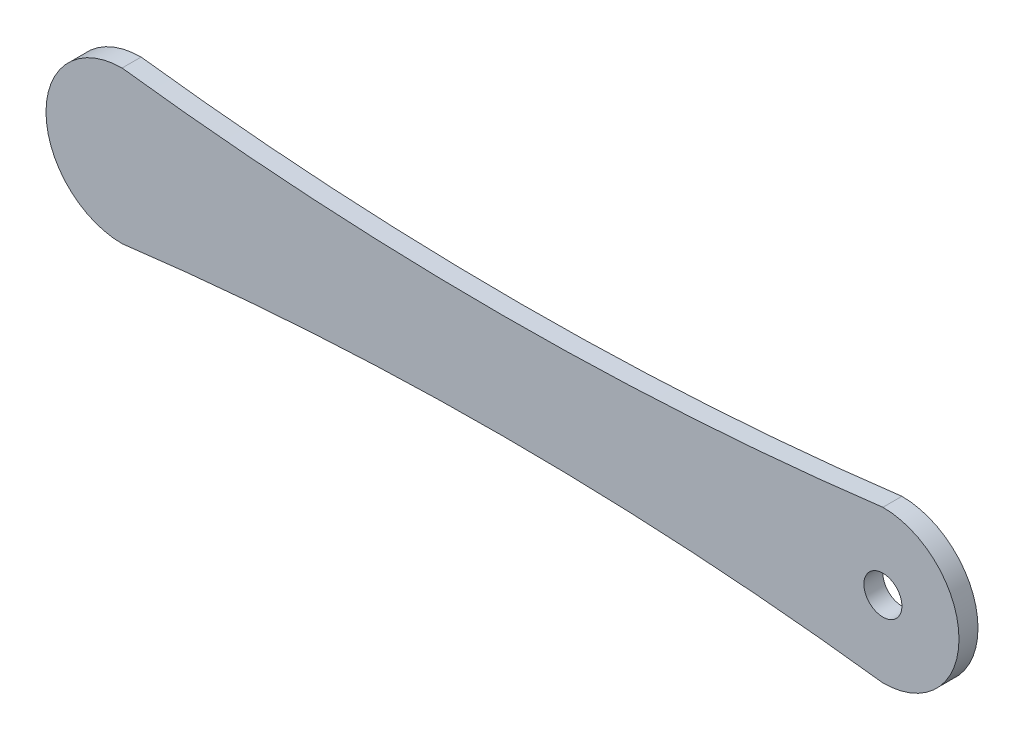
ISO-10303-21;
HEADER;
FILE_DESCRIPTION(('STEP AP214'),'2;1');
FILE_NAME('part.step','',(''),(''),'','','');
FILE_SCHEMA(('AUTOMOTIVE_DESIGN { 1 0 10303 214 1 1 1 1 }'));
ENDSEC;
DATA;
#1=APPLICATION_CONTEXT('core data for automotive mechanical design processes');
#2=APPLICATION_PROTOCOL_DEFINITION('international standard','automotive_design',2000,#1);
#3=PRODUCT_CONTEXT('',#1,'mechanical');
#4=PRODUCT('Part','Part','',(#3));
#5=PRODUCT_RELATED_PRODUCT_CATEGORY('part','',(#4));
#6=PRODUCT_DEFINITION_FORMATION('','',#4);
#7=PRODUCT_DEFINITION_CONTEXT('part definition',#1,'design');
#8=PRODUCT_DEFINITION('design','',#6,#7);
#9=PRODUCT_DEFINITION_SHAPE('','',#8);
#10=(LENGTH_UNIT() NAMED_UNIT(*) SI_UNIT(.MILLI.,.METRE.));
#11=(NAMED_UNIT(*) PLANE_ANGLE_UNIT() SI_UNIT($,.RADIAN.));
#12=(NAMED_UNIT(*) SI_UNIT($,.STERADIAN.) SOLID_ANGLE_UNIT());
#13=UNCERTAINTY_MEASURE_WITH_UNIT(LENGTH_MEASURE(1.E-05),#10,'distance_accuracy_value','');
#14=(GEOMETRIC_REPRESENTATION_CONTEXT(3) GLOBAL_UNCERTAINTY_ASSIGNED_CONTEXT((#13)) GLOBAL_UNIT_ASSIGNED_CONTEXT((#10,
#11,#12)) REPRESENTATION_CONTEXT('',''));
#15=CARTESIAN_POINT('',(0.,0.,0.));
#16=DIRECTION('',(0.,0.,1.));
#17=DIRECTION('',(1.,0.,0.));
#18=AXIS2_PLACEMENT_3D('',#15,#16,#17);
#19=CARTESIAN_POINT('',(-1.29406273472362E-12,4068.62696659689,25.));
#20=DIRECTION('',(0.,0.,-1.));
#21=DIRECTION('',(-1.,0.,0.));
#22=AXIS2_PLACEMENT_3D('',#19,#20,#21);
#23=CYLINDRICAL_SURFACE('',#22,4000.);
#24=CARTESIAN_POINT('',(-1.29406273472362E-12,4068.62696659689,0.));
#25=DIRECTION('',(0.,0.,-1.));
#26=DIRECTION('',(1.,0.,0.));
#27=AXIS2_PLACEMENT_3D('',#24,#25,#26);
#28=CIRCLE('',#27,4000.);
#29=CARTESIAN_POINT('',(500.,99.9999999999996,0.));
#30=VERTEX_POINT('',#29);
#31=CARTESIAN_POINT('',(-500.,100.,0.));
#32=VERTEX_POINT('',#31);
#33=EDGE_CURVE('E101',#30,#32,#28,.T.);
#34=ORIENTED_EDGE('',*,*,#33,.T.);
#35=DIRECTION('',(0.,0.,-1.));
#36=VECTOR('',#35,1.);
#37=CARTESIAN_POINT('',(-500.,100.,25.));
#38=LINE('',#37,#36);
#39=CARTESIAN_POINT('',(-500.,100.,25.));
#40=VERTEX_POINT('',#39);
#41=EDGE_CURVE('E43',#40,#32,#38,.T.);
#42=ORIENTED_EDGE('',*,*,#41,.F.);
#43=CARTESIAN_POINT('',(-1.29406273472362E-12,4068.62696659689,25.));
#44=DIRECTION('',(0.,0.,-1.));
#45=DIRECTION('',(1.,0.,0.));
#46=AXIS2_PLACEMENT_3D('',#43,#44,#45);
#47=CIRCLE('',#46,4000.);
#48=CARTESIAN_POINT('',(500.,99.9999999999996,25.));
#49=VERTEX_POINT('',#48);
#50=EDGE_CURVE('E87',#49,#40,#47,.T.);
#51=ORIENTED_EDGE('',*,*,#50,.F.);
#52=DIRECTION('',(0.,0.,-1.));
#53=VECTOR('',#52,1.);
#54=CARTESIAN_POINT('',(500.,99.9999999999996,25.));
#55=LINE('',#54,#53);
#56=EDGE_CURVE('E97',#49,#30,#55,.T.);
#57=ORIENTED_EDGE('',*,*,#56,.T.);
#58=EDGE_LOOP('',(#34,#42,#51,#57));
#59=FACE_BOUND('',#58,.T.);
#60=ADVANCED_FACE('F35',(#59),#23,.F.);
#61=CARTESIAN_POINT('',(-500.,0.,25.));
#62=DIRECTION('',(0.,0.,-1.));
#63=DIRECTION('',(-1.,0.,0.));
#64=AXIS2_PLACEMENT_3D('',#61,#62,#63);
#65=CYLINDRICAL_SURFACE('',#64,100.);
#66=CARTESIAN_POINT('',(-500.,0.,0.));
#67=DIRECTION('',(0.,0.,1.));
#68=DIRECTION('',(1.,0.,0.));
#69=AXIS2_PLACEMENT_3D('',#66,#67,#68);
#70=CIRCLE('',#69,100.);
#71=CARTESIAN_POINT('',(-500.,-100.,0.));
#72=VERTEX_POINT('',#71);
#73=EDGE_CURVE('E92',#32,#72,#70,.T.);
#74=ORIENTED_EDGE('',*,*,#73,.T.);
#75=DIRECTION('',(0.,0.,-1.));
#76=VECTOR('',#75,1.);
#77=CARTESIAN_POINT('',(-500.,-100.,25.));
#78=LINE('',#77,#76);
#79=CARTESIAN_POINT('',(-500.,-100.,25.));
#80=VERTEX_POINT('',#79);
#81=EDGE_CURVE('E90',#80,#72,#78,.T.);
#82=ORIENTED_EDGE('',*,*,#81,.F.);
#83=CARTESIAN_POINT('',(-500.,0.,25.));
#84=DIRECTION('',(0.,0.,1.));
#85=DIRECTION('',(1.,0.,0.));
#86=AXIS2_PLACEMENT_3D('',#83,#84,#85);
#87=CIRCLE('',#86,100.);
#88=EDGE_CURVE('E82',#40,#80,#87,.T.);
#89=ORIENTED_EDGE('',*,*,#88,.F.);
#90=ORIENTED_EDGE('',*,*,#41,.T.);
#91=EDGE_LOOP('',(#74,#82,#89,#90));
#92=FACE_BOUND('',#91,.T.);
#93=ADVANCED_FACE('F91',(#92),#65,.T.);
#94=CARTESIAN_POINT('',(-1.29406273472362E-12,-4068.62696659689,25.));
#95=DIRECTION('',(0.,0.,-1.));
#96=DIRECTION('',(-1.,0.,0.));
#97=AXIS2_PLACEMENT_3D('',#94,#95,#96);
#98=CYLINDRICAL_SURFACE('',#97,4000.);
#99=CARTESIAN_POINT('',(-1.29406273472362E-12,-4068.62696659689,0.));
#100=DIRECTION('',(0.,0.,-1.));
#101=DIRECTION('',(-1.,0.,0.));
#102=AXIS2_PLACEMENT_3D('',#99,#100,#101);
#103=CIRCLE('',#102,4000.);
#104=CARTESIAN_POINT('',(500.,-100.,0.));
#105=VERTEX_POINT('',#104);
#106=EDGE_CURVE('E68',#72,#105,#103,.T.);
#107=ORIENTED_EDGE('',*,*,#106,.T.);
#108=DIRECTION('',(0.,0.,-1.));
#109=VECTOR('',#108,1.);
#110=CARTESIAN_POINT('',(500.,-100.,25.));
#111=LINE('',#110,#109);
#112=CARTESIAN_POINT('',(500.,-100.,25.));
#113=VERTEX_POINT('',#112);
#114=EDGE_CURVE('E93',#113,#105,#111,.T.);
#115=ORIENTED_EDGE('',*,*,#114,.F.);
#116=CARTESIAN_POINT('',(-1.29406273472362E-12,-4068.62696659689,25.));
#117=DIRECTION('',(0.,0.,-1.));
#118=DIRECTION('',(-1.,0.,0.));
#119=AXIS2_PLACEMENT_3D('',#116,#117,#118);
#120=CIRCLE('',#119,4000.);
#121=EDGE_CURVE('E85',#80,#113,#120,.T.);
#122=ORIENTED_EDGE('',*,*,#121,.F.);
#123=ORIENTED_EDGE('',*,*,#81,.T.);
#124=EDGE_LOOP('',(#107,#115,#122,#123));
#125=FACE_BOUND('',#124,.T.);
#126=ADVANCED_FACE('F95',(#125),#98,.F.);
#127=CARTESIAN_POINT('',(500.,-1.90819582357449E-13,25.));
#128=DIRECTION('',(0.,0.,-1.));
#129=DIRECTION('',(-1.,0.,0.));
#130=AXIS2_PLACEMENT_3D('',#127,#128,#129);
#131=CYLINDRICAL_SURFACE('',#130,99.9999999999998);
#132=CARTESIAN_POINT('',(500.,-1.90819582357449E-13,0.));
#133=DIRECTION('',(0.,0.,1.));
#134=DIRECTION('',(1.,0.,0.));
#135=AXIS2_PLACEMENT_3D('',#132,#133,#134);
#136=CIRCLE('',#135,99.9999999999998);
#137=EDGE_CURVE('E74',#105,#30,#136,.T.);
#138=ORIENTED_EDGE('',*,*,#137,.T.);
#139=ORIENTED_EDGE('',*,*,#56,.F.);
#140=CARTESIAN_POINT('',(500.,-1.90819582357449E-13,25.));
#141=DIRECTION('',(0.,0.,1.));
#142=DIRECTION('',(1.,0.,0.));
#143=AXIS2_PLACEMENT_3D('',#140,#141,#142);
#144=CIRCLE('',#143,99.9999999999998);
#145=EDGE_CURVE('E51',#113,#49,#144,.T.);
#146=ORIENTED_EDGE('',*,*,#145,.F.);
#147=ORIENTED_EDGE('',*,*,#114,.T.);
#148=EDGE_LOOP('',(#138,#139,#146,#147));
#149=FACE_BOUND('',#148,.T.);
#150=ADVANCED_FACE('F124',(#149),#131,.T.);
#151=CARTESIAN_POINT('',(249.999999999999,2034.31348329844,25.));
#152=DIRECTION('',(0.,0.,1.));
#153=DIRECTION('',(1.,0.,0.));
#154=AXIS2_PLACEMENT_3D('',#151,#152,#153);
#155=PLANE('',#154);
#156=CARTESIAN_POINT('',(500.,0.,25.));
#157=DIRECTION('',(0.,0.,1.));
#158=DIRECTION('',(-1.,0.,0.));
#159=AXIS2_PLACEMENT_3D('',#156,#157,#158);
#160=CIRCLE('',#159,25.);
#161=CARTESIAN_POINT('',(475.,0.,25.));
#162=VERTEX_POINT('',#161);
#163=EDGE_CURVE('E184',#162,#162,#160,.T.);
#164=ORIENTED_EDGE('',*,*,#163,.F.);
#165=EDGE_LOOP('',(#164));
#166=FACE_BOUND('',#165,.T.);
#167=ORIENTED_EDGE('',*,*,#50,.T.);
#168=ORIENTED_EDGE('',*,*,#88,.T.);
#169=ORIENTED_EDGE('',*,*,#121,.T.);
#170=ORIENTED_EDGE('',*,*,#145,.T.);
#171=EDGE_LOOP('',(#167,#168,#169,#170));
#172=FACE_BOUND('',#171,.T.);
#173=ADVANCED_FACE('F83',(#166,#172),#155,.T.);
#174=CARTESIAN_POINT('',(249.999999999999,2034.31348329844,0.));
#175=DIRECTION('',(0.,0.,1.));
#176=DIRECTION('',(1.,0.,0.));
#177=AXIS2_PLACEMENT_3D('',#174,#175,#176);
#178=PLANE('',#177);
#179=CARTESIAN_POINT('',(500.,0.,0.));
#180=DIRECTION('',(0.,0.,1.));
#181=DIRECTION('',(-1.,0.,0.));
#182=AXIS2_PLACEMENT_3D('',#179,#180,#181);
#183=CIRCLE('',#182,25.);
#184=CARTESIAN_POINT('',(475.,0.,0.));
#185=VERTEX_POINT('',#184);
#186=EDGE_CURVE('E182',#185,#185,#183,.T.);
#187=ORIENTED_EDGE('',*,*,#186,.T.);
#188=EDGE_LOOP('',(#187));
#189=FACE_BOUND('',#188,.T.);
#190=CARTESIAN_POINT('',(-500.,0.,0.));
#191=DIRECTION('',(0.,0.,1.));
#192=DIRECTION('',(1.,0.,0.));
#193=AXIS2_PLACEMENT_3D('',#190,#191,#192);
#194=CIRCLE('',#193,50.);
#195=CARTESIAN_POINT('',(-450.,0.,0.));
#196=VERTEX_POINT('',#195);
#197=EDGE_CURVE('E11',#196,#196,#194,.F.);
#198=ORIENTED_EDGE('',*,*,#197,.F.);
#199=EDGE_LOOP('',(#198));
#200=FACE_BOUND('',#199,.T.);
#201=ORIENTED_EDGE('',*,*,#33,.F.);
#202=ORIENTED_EDGE('',*,*,#137,.F.);
#203=ORIENTED_EDGE('',*,*,#106,.F.);
#204=ORIENTED_EDGE('',*,*,#73,.F.);
#205=EDGE_LOOP('',(#201,#202,#203,#204));
#206=FACE_BOUND('',#205,.T.);
#207=ADVANCED_FACE('F112',(#189,#200,#206),#178,.F.);
#208=CARTESIAN_POINT('',(-500.,0.,-25.));
#209=DIRECTION('',(0.,0.,1.));
#210=DIRECTION('',(0.,-1.,0.));
#211=AXIS2_PLACEMENT_3D('',#208,#209,#210);
#212=CYLINDRICAL_SURFACE('',#211,50.);
#213=CARTESIAN_POINT('',(-500.,0.,-25.));
#214=DIRECTION('',(0.,0.,-1.));
#215=DIRECTION('',(0.,1.,0.));
#216=AXIS2_PLACEMENT_3D('',#213,#214,#215);
#217=CIRCLE('',#216,50.);
#218=CARTESIAN_POINT('',(-500.,50.,-25.));
#219=VERTEX_POINT('',#218);
#220=EDGE_CURVE('E104',#219,#219,#217,.T.);
#221=ORIENTED_EDGE('',*,*,#220,.F.);
#222=EDGE_LOOP('',(#221));
#223=FACE_BOUND('',#222,.T.);
#224=ORIENTED_EDGE('',*,*,#197,.T.);
#225=EDGE_LOOP('',(#224));
#226=FACE_BOUND('',#225,.T.);
#227=ADVANCED_FACE('F114',(#223,#226),#212,.T.);
#228=CARTESIAN_POINT('',(-500.,0.,-25.));
#229=DIRECTION('',(0.,0.,-1.));
#230=DIRECTION('',(0.,1.,0.));
#231=AXIS2_PLACEMENT_3D('',#228,#229,#230);
#232=PLANE('',#231);
#233=ORIENTED_EDGE('',*,*,#220,.T.);
#234=EDGE_LOOP('',(#233));
#235=FACE_BOUND('',#234,.T.);
#236=ADVANCED_FACE('F121',(#235),#232,.T.);
#237=CARTESIAN_POINT('',(500.,0.,0.));
#238=DIRECTION('',(0.,0.,1.));
#239=DIRECTION('',(1.,0.,0.));
#240=AXIS2_PLACEMENT_3D('',#237,#238,#239);
#241=CYLINDRICAL_SURFACE('',#240,25.);
#242=ORIENTED_EDGE('',*,*,#186,.F.);
#243=EDGE_LOOP('',(#242));
#244=FACE_BOUND('',#243,.T.);
#245=ORIENTED_EDGE('',*,*,#163,.T.);
#246=EDGE_LOOP('',(#245));
#247=FACE_BOUND('',#246,.T.);
#248=ADVANCED_FACE('F162',(#244,#247),#241,.F.);
#249=CLOSED_SHELL('',(#60,#93,#126,#150,#173,#207,#227,#236,#248));
#250=MANIFOLD_SOLID_BREP('B2',#249);
#251=ADVANCED_BREP_SHAPE_REPRESENTATION('',(#18,#250),#14);
#252=SHAPE_DEFINITION_REPRESENTATION(#9,#251);
ENDSEC;
END-ISO-10303-21;
